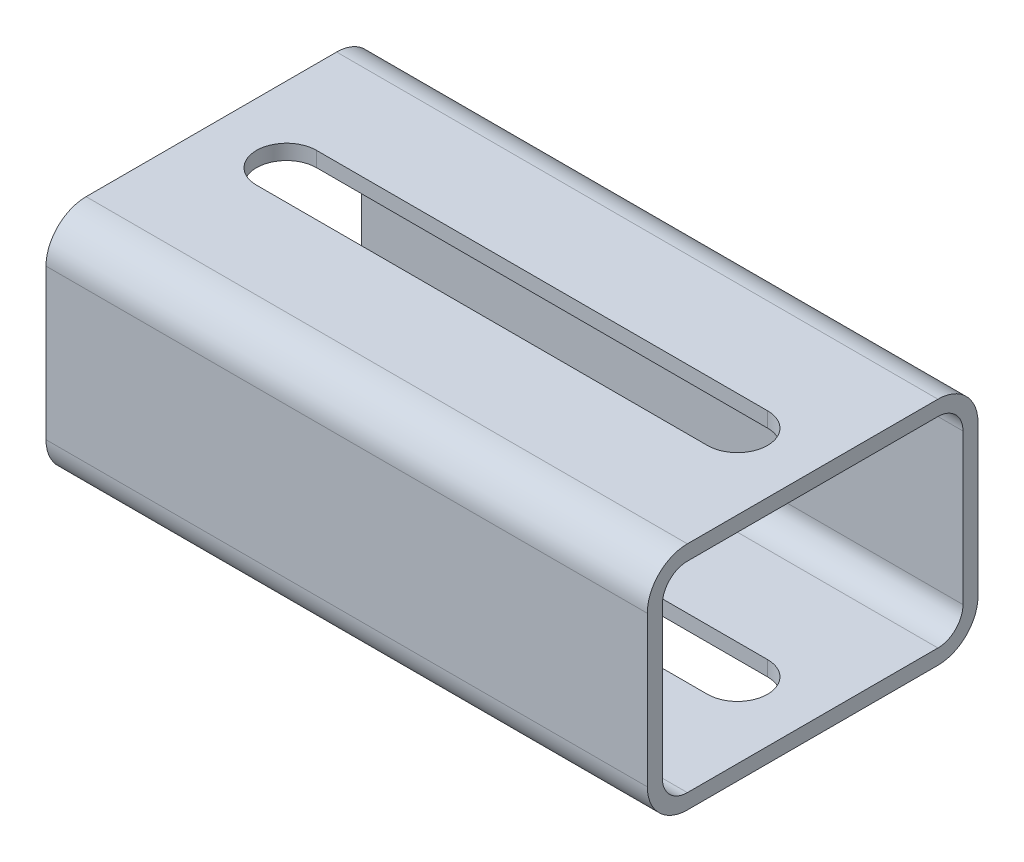
ISO-10303-21;
HEADER;
FILE_DESCRIPTION(('STEP AP214'),'2;1');
FILE_NAME('part.step','',(''),(''),'','','');
FILE_SCHEMA(('AUTOMOTIVE_DESIGN { 1 0 10303 214 1 1 1 1 }'));
ENDSEC;
DATA;
#1=APPLICATION_CONTEXT('core data for automotive mechanical design processes');
#2=APPLICATION_PROTOCOL_DEFINITION('international standard','automotive_design',2000,#1);
#3=PRODUCT_CONTEXT('',#1,'mechanical');
#4=PRODUCT('Part','Part','',(#3));
#5=PRODUCT_RELATED_PRODUCT_CATEGORY('part','',(#4));
#6=PRODUCT_DEFINITION_FORMATION('','',#4);
#7=PRODUCT_DEFINITION_CONTEXT('part definition',#1,'design');
#8=PRODUCT_DEFINITION('design','',#6,#7);
#9=PRODUCT_DEFINITION_SHAPE('','',#8);
#10=(LENGTH_UNIT() NAMED_UNIT(*) SI_UNIT(.MILLI.,.METRE.));
#11=(NAMED_UNIT(*) PLANE_ANGLE_UNIT() SI_UNIT($,.RADIAN.));
#12=(NAMED_UNIT(*) SI_UNIT($,.STERADIAN.) SOLID_ANGLE_UNIT());
#13=UNCERTAINTY_MEASURE_WITH_UNIT(LENGTH_MEASURE(1.E-05),#10,'distance_accuracy_value','');
#14=(GEOMETRIC_REPRESENTATION_CONTEXT(3) GLOBAL_UNCERTAINTY_ASSIGNED_CONTEXT((#13)) GLOBAL_UNIT_ASSIGNED_CONTEXT((#10,
#11,#12)) REPRESENTATION_CONTEXT('',''));
#15=CARTESIAN_POINT('',(0.,0.,0.));
#16=DIRECTION('',(0.,0.,1.));
#17=DIRECTION('',(1.,0.,0.));
#18=AXIS2_PLACEMENT_3D('',#15,#16,#17);
#19=CARTESIAN_POINT('',(60.,-15.,25.));
#20=DIRECTION('',(1.,0.,0.));
#21=DIRECTION('',(0.,0.,-1.));
#22=AXIS2_PLACEMENT_3D('',#19,#20,#21);
#23=PLANE('',#22);
#24=CARTESIAN_POINT('',(60.,-15.,25.));
#25=DIRECTION('',(1.,0.,0.));
#26=DIRECTION('',(0.,0.,-1.));
#27=AXIS2_PLACEMENT_3D('',#24,#25,#26);
#28=CIRCLE('',#27,8.);
#29=CARTESIAN_POINT('',(60.,-15.,33.));
#30=VERTEX_POINT('',#29);
#31=CARTESIAN_POINT('',(60.,-23.,25.));
#32=VERTEX_POINT('',#31);
#33=EDGE_CURVE('E403',#30,#32,#28,.T.);
#34=ORIENTED_EDGE('',*,*,#33,.T.);
#35=DIRECTION('',(0.,0.,-1.));
#36=VECTOR('',#35,1.);
#37=CARTESIAN_POINT('',(60.,-23.,25.));
#38=LINE('',#37,#36);
#39=CARTESIAN_POINT('',(60.,-23.,-25.));
#40=VERTEX_POINT('',#39);
#41=EDGE_CURVE('E407',#32,#40,#38,.T.);
#42=ORIENTED_EDGE('',*,*,#41,.T.);
#43=CARTESIAN_POINT('',(60.,-15.,-25.));
#44=DIRECTION('',(1.,0.,0.));
#45=DIRECTION('',(0.,0.,-1.));
#46=AXIS2_PLACEMENT_3D('',#43,#44,#45);
#47=CIRCLE('',#46,8.);
#48=CARTESIAN_POINT('',(60.,-14.9999999999999,-33.));
#49=VERTEX_POINT('',#48);
#50=EDGE_CURVE('E411',#40,#49,#47,.T.);
#51=ORIENTED_EDGE('',*,*,#50,.T.);
#52=DIRECTION('',(0.,1.,0.));
#53=VECTOR('',#52,1.);
#54=CARTESIAN_POINT('',(60.,15.,-33.));
#55=LINE('',#54,#53);
#56=CARTESIAN_POINT('',(60.,15.,-33.));
#57=VERTEX_POINT('',#56);
#58=EDGE_CURVE('E414',#49,#57,#55,.T.);
#59=ORIENTED_EDGE('',*,*,#58,.T.);
#60=CARTESIAN_POINT('',(60.,15.,-25.));
#61=DIRECTION('',(1.,0.,0.));
#62=DIRECTION('',(0.,0.,-1.));
#63=AXIS2_PLACEMENT_3D('',#60,#61,#62);
#64=CIRCLE('',#63,8.);
#65=CARTESIAN_POINT('',(60.,23.,-24.9999999999999));
#66=VERTEX_POINT('',#65);
#67=EDGE_CURVE('E417',#57,#66,#64,.T.);
#68=ORIENTED_EDGE('',*,*,#67,.T.);
#69=DIRECTION('',(0.,0.,1.));
#70=VECTOR('',#69,1.);
#71=CARTESIAN_POINT('',(60.,23.,25.));
#72=LINE('',#71,#70);
#73=CARTESIAN_POINT('',(60.,23.,25.));
#74=VERTEX_POINT('',#73);
#75=EDGE_CURVE('E420',#66,#74,#72,.T.);
#76=ORIENTED_EDGE('',*,*,#75,.T.);
#77=CARTESIAN_POINT('',(60.,15.,25.));
#78=DIRECTION('',(1.,0.,0.));
#79=DIRECTION('',(0.,0.,-1.));
#80=AXIS2_PLACEMENT_3D('',#77,#78,#79);
#81=CIRCLE('',#80,8.);
#82=CARTESIAN_POINT('',(60.,14.9999999999999,33.));
#83=VERTEX_POINT('',#82);
#84=EDGE_CURVE('E423',#74,#83,#81,.T.);
#85=ORIENTED_EDGE('',*,*,#84,.T.);
#86=DIRECTION('',(0.,-1.,0.));
#87=VECTOR('',#86,1.);
#88=CARTESIAN_POINT('',(60.,15.,33.));
#89=LINE('',#88,#87);
#90=EDGE_CURVE('E426',#83,#30,#89,.T.);
#91=ORIENTED_EDGE('',*,*,#90,.T.);
#92=EDGE_LOOP('',(#34,#42,#51,#59,#68,#76,#85,#91));
#93=FACE_BOUND('',#92,.T.);
#94=DIRECTION('',(0.,0.,-1.));
#95=VECTOR('',#94,1.);
#96=CARTESIAN_POINT('',(60.,-20.,25.));
#97=LINE('',#96,#95);
#98=CARTESIAN_POINT('',(60.,-20.,25.));
#99=VERTEX_POINT('',#98);
#100=CARTESIAN_POINT('',(60.,-20.,-25.));
#101=VERTEX_POINT('',#100);
#102=EDGE_CURVE('E323',#99,#101,#97,.T.);
#103=ORIENTED_EDGE('',*,*,#102,.F.);
#104=CARTESIAN_POINT('',(60.,-15.,25.));
#105=DIRECTION('',(1.,0.,0.));
#106=DIRECTION('',(0.,0.,-1.));
#107=AXIS2_PLACEMENT_3D('',#104,#105,#106);
#108=CIRCLE('',#107,5.);
#109=CARTESIAN_POINT('',(60.,-15.,30.));
#110=VERTEX_POINT('',#109);
#111=EDGE_CURVE('E320',#110,#99,#108,.T.);
#112=ORIENTED_EDGE('',*,*,#111,.F.);
#113=DIRECTION('',(0.,-1.,0.));
#114=VECTOR('',#113,1.);
#115=CARTESIAN_POINT('',(60.,15.,30.));
#116=LINE('',#115,#114);
#117=CARTESIAN_POINT('',(60.,15.,30.));
#118=VERTEX_POINT('',#117);
#119=EDGE_CURVE('E343',#118,#110,#116,.T.);
#120=ORIENTED_EDGE('',*,*,#119,.F.);
#121=CARTESIAN_POINT('',(60.,15.,25.));
#122=DIRECTION('',(1.,0.,0.));
#123=DIRECTION('',(0.,0.,-1.));
#124=AXIS2_PLACEMENT_3D('',#121,#122,#123);
#125=CIRCLE('',#124,5.);
#126=CARTESIAN_POINT('',(60.,20.,25.));
#127=VERTEX_POINT('',#126);
#128=EDGE_CURVE('E339',#127,#118,#125,.T.);
#129=ORIENTED_EDGE('',*,*,#128,.F.);
#130=DIRECTION('',(0.,0.,1.));
#131=VECTOR('',#130,1.);
#132=CARTESIAN_POINT('',(60.,20.,25.));
#133=LINE('',#132,#131);
#134=CARTESIAN_POINT('',(60.,20.,-25.));
#135=VERTEX_POINT('',#134);
#136=EDGE_CURVE('E336',#135,#127,#133,.T.);
#137=ORIENTED_EDGE('',*,*,#136,.F.);
#138=CARTESIAN_POINT('',(60.,15.,-25.));
#139=DIRECTION('',(1.,0.,0.));
#140=DIRECTION('',(0.,0.,1.));
#141=AXIS2_PLACEMENT_3D('',#138,#139,#140);
#142=CIRCLE('',#141,5.);
#143=CARTESIAN_POINT('',(60.,15.,-30.));
#144=VERTEX_POINT('',#143);
#145=EDGE_CURVE('E333',#144,#135,#142,.T.);
#146=ORIENTED_EDGE('',*,*,#145,.F.);
#147=DIRECTION('',(0.,1.,0.));
#148=VECTOR('',#147,1.);
#149=CARTESIAN_POINT('',(60.,15.,-30.));
#150=LINE('',#149,#148);
#151=CARTESIAN_POINT('',(60.,-15.,-30.));
#152=VERTEX_POINT('',#151);
#153=EDGE_CURVE('E330',#152,#144,#150,.T.);
#154=ORIENTED_EDGE('',*,*,#153,.F.);
#155=CARTESIAN_POINT('',(60.,-15.,-25.));
#156=DIRECTION('',(1.,0.,0.));
#157=DIRECTION('',(0.,0.,-1.));
#158=AXIS2_PLACEMENT_3D('',#155,#156,#157);
#159=CIRCLE('',#158,5.);
#160=EDGE_CURVE('E327',#101,#152,#159,.T.);
#161=ORIENTED_EDGE('',*,*,#160,.F.);
#162=EDGE_LOOP('',(#103,#112,#120,#129,#137,#146,#154,#161));
#163=FACE_BOUND('',#162,.T.);
#164=ADVANCED_FACE('F87',(#93,#163),#23,.T.);
#165=CARTESIAN_POINT('',(-60.,-15.,25.));
#166=DIRECTION('',(1.,0.,0.));
#167=DIRECTION('',(0.,0.,-1.));
#168=AXIS2_PLACEMENT_3D('',#165,#166,#167);
#169=PLANE('',#168);
#170=CARTESIAN_POINT('',(-60.,-15.,25.));
#171=DIRECTION('',(1.,0.,0.));
#172=DIRECTION('',(0.,0.,-1.));
#173=AXIS2_PLACEMENT_3D('',#170,#171,#172);
#174=CIRCLE('',#173,8.);
#175=CARTESIAN_POINT('',(-60.,-15.,33.));
#176=VERTEX_POINT('',#175);
#177=CARTESIAN_POINT('',(-60.,-23.,25.));
#178=VERTEX_POINT('',#177);
#179=EDGE_CURVE('E402',#176,#178,#174,.T.);
#180=ORIENTED_EDGE('',*,*,#179,.F.);
#181=DIRECTION('',(0.,-1.,0.));
#182=VECTOR('',#181,1.);
#183=CARTESIAN_POINT('',(-60.,15.,33.));
#184=LINE('',#183,#182);
#185=CARTESIAN_POINT('',(-60.,14.9999999999999,33.));
#186=VERTEX_POINT('',#185);
#187=EDGE_CURVE('E408',#186,#176,#184,.T.);
#188=ORIENTED_EDGE('',*,*,#187,.F.);
#189=CARTESIAN_POINT('',(-60.,15.,25.));
#190=DIRECTION('',(1.,0.,0.));
#191=DIRECTION('',(0.,0.,-1.));
#192=AXIS2_PLACEMENT_3D('',#189,#190,#191);
#193=CIRCLE('',#192,8.);
#194=CARTESIAN_POINT('',(-60.,23.,25.));
#195=VERTEX_POINT('',#194);
#196=EDGE_CURVE('E448',#195,#186,#193,.T.);
#197=ORIENTED_EDGE('',*,*,#196,.F.);
#198=DIRECTION('',(0.,0.,1.));
#199=VECTOR('',#198,1.);
#200=CARTESIAN_POINT('',(-60.,23.,25.));
#201=LINE('',#200,#199);
#202=CARTESIAN_POINT('',(-60.,23.,-24.9999999999999));
#203=VERTEX_POINT('',#202);
#204=EDGE_CURVE('E445',#203,#195,#201,.T.);
#205=ORIENTED_EDGE('',*,*,#204,.F.);
#206=CARTESIAN_POINT('',(-60.,15.,-25.));
#207=DIRECTION('',(1.,0.,0.));
#208=DIRECTION('',(0.,0.,-1.));
#209=AXIS2_PLACEMENT_3D('',#206,#207,#208);
#210=CIRCLE('',#209,8.);
#211=CARTESIAN_POINT('',(-60.,15.,-33.));
#212=VERTEX_POINT('',#211);
#213=EDGE_CURVE('E442',#212,#203,#210,.T.);
#214=ORIENTED_EDGE('',*,*,#213,.F.);
#215=DIRECTION('',(0.,1.,0.));
#216=VECTOR('',#215,1.);
#217=CARTESIAN_POINT('',(-60.,15.,-33.));
#218=LINE('',#217,#216);
#219=CARTESIAN_POINT('',(-60.,-14.9999999999999,-33.));
#220=VERTEX_POINT('',#219);
#221=EDGE_CURVE('E439',#220,#212,#218,.T.);
#222=ORIENTED_EDGE('',*,*,#221,.F.);
#223=CARTESIAN_POINT('',(-60.,-15.,-25.));
#224=DIRECTION('',(1.,0.,0.));
#225=DIRECTION('',(0.,0.,-1.));
#226=AXIS2_PLACEMENT_3D('',#223,#224,#225);
#227=CIRCLE('',#226,8.);
#228=CARTESIAN_POINT('',(-60.,-23.,-25.));
#229=VERTEX_POINT('',#228);
#230=EDGE_CURVE('E436',#229,#220,#227,.T.);
#231=ORIENTED_EDGE('',*,*,#230,.F.);
#232=DIRECTION('',(0.,0.,-1.));
#233=VECTOR('',#232,1.);
#234=CARTESIAN_POINT('',(-60.,-23.,25.));
#235=LINE('',#234,#233);
#236=EDGE_CURVE('E433',#178,#229,#235,.T.);
#237=ORIENTED_EDGE('',*,*,#236,.F.);
#238=EDGE_LOOP('',(#180,#188,#197,#205,#214,#222,#231,#237));
#239=FACE_BOUND('',#238,.T.);
#240=CARTESIAN_POINT('',(-60.,-15.,25.));
#241=DIRECTION('',(1.,0.,0.));
#242=DIRECTION('',(0.,0.,-1.));
#243=AXIS2_PLACEMENT_3D('',#240,#241,#242);
#244=CIRCLE('',#243,5.);
#245=CARTESIAN_POINT('',(-60.,-15.,30.));
#246=VERTEX_POINT('',#245);
#247=CARTESIAN_POINT('',(-60.,-20.,25.));
#248=VERTEX_POINT('',#247);
#249=EDGE_CURVE('E319',#246,#248,#244,.T.);
#250=ORIENTED_EDGE('',*,*,#249,.T.);
#251=DIRECTION('',(0.,0.,-1.));
#252=VECTOR('',#251,1.);
#253=CARTESIAN_POINT('',(-60.,-20.,25.));
#254=LINE('',#253,#252);
#255=CARTESIAN_POINT('',(-60.,-20.,-25.));
#256=VERTEX_POINT('',#255);
#257=EDGE_CURVE('E350',#248,#256,#254,.T.);
#258=ORIENTED_EDGE('',*,*,#257,.T.);
#259=CARTESIAN_POINT('',(-60.,-15.,-25.));
#260=DIRECTION('',(1.,0.,0.));
#261=DIRECTION('',(0.,0.,-1.));
#262=AXIS2_PLACEMENT_3D('',#259,#260,#261);
#263=CIRCLE('',#262,5.);
#264=CARTESIAN_POINT('',(-60.,-15.,-30.));
#265=VERTEX_POINT('',#264);
#266=EDGE_CURVE('E354',#256,#265,#263,.T.);
#267=ORIENTED_EDGE('',*,*,#266,.T.);
#268=DIRECTION('',(0.,1.,0.));
#269=VECTOR('',#268,1.);
#270=CARTESIAN_POINT('',(-60.,15.,-30.));
#271=LINE('',#270,#269);
#272=CARTESIAN_POINT('',(-60.,15.,-30.));
#273=VERTEX_POINT('',#272);
#274=EDGE_CURVE('E358',#265,#273,#271,.T.);
#275=ORIENTED_EDGE('',*,*,#274,.T.);
#276=CARTESIAN_POINT('',(-60.,15.,-25.));
#277=DIRECTION('',(1.,0.,0.));
#278=DIRECTION('',(0.,0.,1.));
#279=AXIS2_PLACEMENT_3D('',#276,#277,#278);
#280=CIRCLE('',#279,5.);
#281=CARTESIAN_POINT('',(-60.,20.,-25.));
#282=VERTEX_POINT('',#281);
#283=EDGE_CURVE('E362',#273,#282,#280,.T.);
#284=ORIENTED_EDGE('',*,*,#283,.T.);
#285=DIRECTION('',(0.,0.,1.));
#286=VECTOR('',#285,1.);
#287=CARTESIAN_POINT('',(-60.,20.,25.));
#288=LINE('',#287,#286);
#289=CARTESIAN_POINT('',(-60.,20.,25.));
#290=VERTEX_POINT('',#289);
#291=EDGE_CURVE('E366',#282,#290,#288,.T.);
#292=ORIENTED_EDGE('',*,*,#291,.T.);
#293=CARTESIAN_POINT('',(-60.,15.,25.));
#294=DIRECTION('',(1.,0.,0.));
#295=DIRECTION('',(0.,0.,-1.));
#296=AXIS2_PLACEMENT_3D('',#293,#294,#295);
#297=CIRCLE('',#296,5.);
#298=CARTESIAN_POINT('',(-60.,15.,30.));
#299=VERTEX_POINT('',#298);
#300=EDGE_CURVE('E370',#290,#299,#297,.T.);
#301=ORIENTED_EDGE('',*,*,#300,.T.);
#302=DIRECTION('',(0.,-1.,0.));
#303=VECTOR('',#302,1.);
#304=CARTESIAN_POINT('',(-60.,15.,30.));
#305=LINE('',#304,#303);
#306=EDGE_CURVE('E324',#299,#246,#305,.T.);
#307=ORIENTED_EDGE('',*,*,#306,.T.);
#308=EDGE_LOOP('',(#250,#258,#267,#275,#284,#292,#301,#307));
#309=FACE_BOUND('',#308,.T.);
#310=ADVANCED_FACE('F533',(#239,#309),#169,.F.);
#311=CARTESIAN_POINT('',(60.,-15.,25.));
#312=DIRECTION('',(-1.,0.,0.));
#313=DIRECTION('',(0.,0.,1.));
#314=AXIS2_PLACEMENT_3D('',#311,#312,#313);
#315=CYLINDRICAL_SURFACE('',#314,8.);
#316=ORIENTED_EDGE('',*,*,#179,.T.);
#317=DIRECTION('',(-1.,0.,0.));
#318=VECTOR('',#317,1.);
#319=CARTESIAN_POINT('',(60.,-23.,25.));
#320=LINE('',#319,#318);
#321=EDGE_CURVE('E480',#32,#178,#320,.T.);
#322=ORIENTED_EDGE('',*,*,#321,.F.);
#323=ORIENTED_EDGE('',*,*,#33,.F.);
#324=DIRECTION('',(-1.,0.,0.));
#325=VECTOR('',#324,1.);
#326=CARTESIAN_POINT('',(60.,-15.,33.));
#327=LINE('',#326,#325);
#328=EDGE_CURVE('E429',#30,#176,#327,.T.);
#329=ORIENTED_EDGE('',*,*,#328,.T.);
#330=EDGE_LOOP('',(#316,#322,#323,#329));
#331=FACE_BOUND('',#330,.T.);
#332=ADVANCED_FACE('F89',(#331),#315,.T.);
#333=CARTESIAN_POINT('',(60.,-23.,25.));
#334=DIRECTION('',(0.,1.,0.));
#335=DIRECTION('',(0.,0.,1.));
#336=AXIS2_PLACEMENT_3D('',#333,#334,#335);
#337=PLANE('',#336);
#338=DIRECTION('',(-1.,0.,0.));
#339=VECTOR('',#338,1.);
#340=CARTESIAN_POINT('',(-45.,-23.,-6.));
#341=LINE('',#340,#339);
#342=CARTESIAN_POINT('',(45.,-23.,-6.));
#343=VERTEX_POINT('',#342);
#344=CARTESIAN_POINT('',(-45.,-23.,-6.));
#345=VERTEX_POINT('',#344);
#346=EDGE_CURVE('E275',#343,#345,#341,.T.);
#347=ORIENTED_EDGE('',*,*,#346,.T.);
#348=CARTESIAN_POINT('',(-45.,-23.,0.));
#349=DIRECTION('',(0.,1.,0.));
#350=DIRECTION('',(0.,0.,1.));
#351=AXIS2_PLACEMENT_3D('',#348,#349,#350);
#352=CIRCLE('',#351,6.);
#353=CARTESIAN_POINT('',(-45.,-23.,6.));
#354=VERTEX_POINT('',#353);
#355=EDGE_CURVE('E255',#345,#354,#352,.T.);
#356=ORIENTED_EDGE('',*,*,#355,.T.);
#357=DIRECTION('',(1.,0.,0.));
#358=VECTOR('',#357,1.);
#359=CARTESIAN_POINT('',(-45.,-23.,6.));
#360=LINE('',#359,#358);
#361=CARTESIAN_POINT('',(45.,-23.,6.));
#362=VERTEX_POINT('',#361);
#363=EDGE_CURVE('E266',#354,#362,#360,.T.);
#364=ORIENTED_EDGE('',*,*,#363,.T.);
#365=CARTESIAN_POINT('',(45.,-23.,0.));
#366=DIRECTION('',(0.,1.,0.));
#367=DIRECTION('',(0.,0.,1.));
#368=AXIS2_PLACEMENT_3D('',#365,#366,#367);
#369=CIRCLE('',#368,6.);
#370=EDGE_CURVE('E103',#362,#343,#369,.T.);
#371=ORIENTED_EDGE('',*,*,#370,.T.);
#372=EDGE_LOOP('',(#347,#356,#364,#371));
#373=FACE_BOUND('',#372,.T.);
#374=ORIENTED_EDGE('',*,*,#236,.T.);
#375=DIRECTION('',(-1.,0.,0.));
#376=VECTOR('',#375,1.);
#377=CARTESIAN_POINT('',(60.,-23.,-25.));
#378=LINE('',#377,#376);
#379=EDGE_CURVE('E476',#40,#229,#378,.T.);
#380=ORIENTED_EDGE('',*,*,#379,.F.);
#381=ORIENTED_EDGE('',*,*,#41,.F.);
#382=ORIENTED_EDGE('',*,*,#321,.T.);
#383=EDGE_LOOP('',(#374,#380,#381,#382));
#384=FACE_BOUND('',#383,.T.);
#385=ADVANCED_FACE('F272',(#373,#384),#337,.F.);
#386=CARTESIAN_POINT('',(60.,-15.,-25.));
#387=DIRECTION('',(-1.,0.,0.));
#388=DIRECTION('',(0.,0.,1.));
#389=AXIS2_PLACEMENT_3D('',#386,#387,#388);
#390=CYLINDRICAL_SURFACE('',#389,8.);
#391=ORIENTED_EDGE('',*,*,#230,.T.);
#392=DIRECTION('',(-1.,0.,0.));
#393=VECTOR('',#392,1.);
#394=CARTESIAN_POINT('',(60.,-14.9999999999999,-33.));
#395=LINE('',#394,#393);
#396=EDGE_CURVE('E472',#49,#220,#395,.T.);
#397=ORIENTED_EDGE('',*,*,#396,.F.);
#398=ORIENTED_EDGE('',*,*,#50,.F.);
#399=ORIENTED_EDGE('',*,*,#379,.T.);
#400=EDGE_LOOP('',(#391,#397,#398,#399));
#401=FACE_BOUND('',#400,.T.);
#402=ADVANCED_FACE('F556',(#401),#390,.T.);
#403=CARTESIAN_POINT('',(60.,15.,-33.));
#404=DIRECTION('',(0.,0.,1.));
#405=DIRECTION('',(0.,-1.,0.));
#406=AXIS2_PLACEMENT_3D('',#403,#404,#405);
#407=PLANE('',#406);
#408=ORIENTED_EDGE('',*,*,#221,.T.);
#409=DIRECTION('',(-1.,0.,0.));
#410=VECTOR('',#409,1.);
#411=CARTESIAN_POINT('',(60.,15.,-33.));
#412=LINE('',#411,#410);
#413=EDGE_CURVE('E468',#57,#212,#412,.T.);
#414=ORIENTED_EDGE('',*,*,#413,.F.);
#415=ORIENTED_EDGE('',*,*,#58,.F.);
#416=ORIENTED_EDGE('',*,*,#396,.T.);
#417=EDGE_LOOP('',(#408,#414,#415,#416));
#418=FACE_BOUND('',#417,.T.);
#419=ADVANCED_FACE('F552',(#418),#407,.F.);
#420=CARTESIAN_POINT('',(60.,15.,-25.));
#421=DIRECTION('',(-1.,0.,0.));
#422=DIRECTION('',(0.,0.,1.));
#423=AXIS2_PLACEMENT_3D('',#420,#421,#422);
#424=CYLINDRICAL_SURFACE('',#423,8.);
#425=ORIENTED_EDGE('',*,*,#213,.T.);
#426=DIRECTION('',(-1.,0.,0.));
#427=VECTOR('',#426,1.);
#428=CARTESIAN_POINT('',(60.,23.,-24.9999999999999));
#429=LINE('',#428,#427);
#430=EDGE_CURVE('E464',#66,#203,#429,.T.);
#431=ORIENTED_EDGE('',*,*,#430,.F.);
#432=ORIENTED_EDGE('',*,*,#67,.F.);
#433=ORIENTED_EDGE('',*,*,#413,.T.);
#434=EDGE_LOOP('',(#425,#431,#432,#433));
#435=FACE_BOUND('',#434,.T.);
#436=ADVANCED_FACE('F519',(#435),#424,.T.);
#437=CARTESIAN_POINT('',(60.,23.,25.));
#438=DIRECTION('',(0.,-1.,0.));
#439=DIRECTION('',(0.,0.,-1.));
#440=AXIS2_PLACEMENT_3D('',#437,#438,#439);
#441=PLANE('',#440);
#442=DIRECTION('',(1.,0.,0.));
#443=VECTOR('',#442,1.);
#444=CARTESIAN_POINT('',(-45.,23.,6.));
#445=LINE('',#444,#443);
#446=CARTESIAN_POINT('',(-45.,23.,6.));
#447=VERTEX_POINT('',#446);
#448=CARTESIAN_POINT('',(45.,23.,6.));
#449=VERTEX_POINT('',#448);
#450=EDGE_CURVE('E290',#447,#449,#445,.T.);
#451=ORIENTED_EDGE('',*,*,#450,.F.);
#452=CARTESIAN_POINT('',(-45.,23.,0.));
#453=DIRECTION('',(0.,1.,0.));
#454=DIRECTION('',(0.,0.,1.));
#455=AXIS2_PLACEMENT_3D('',#452,#453,#454);
#456=CIRCLE('',#455,6.);
#457=CARTESIAN_POINT('',(-45.,23.,-6.));
#458=VERTEX_POINT('',#457);
#459=EDGE_CURVE('E111',#458,#447,#456,.T.);
#460=ORIENTED_EDGE('',*,*,#459,.F.);
#461=DIRECTION('',(-1.,0.,0.));
#462=VECTOR('',#461,1.);
#463=CARTESIAN_POINT('',(-45.,23.,-6.));
#464=LINE('',#463,#462);
#465=CARTESIAN_POINT('',(45.,23.,-6.));
#466=VERTEX_POINT('',#465);
#467=EDGE_CURVE('E277',#466,#458,#464,.T.);
#468=ORIENTED_EDGE('',*,*,#467,.F.);
#469=CARTESIAN_POINT('',(45.,23.,0.));
#470=DIRECTION('',(0.,1.,0.));
#471=DIRECTION('',(0.,0.,1.));
#472=AXIS2_PLACEMENT_3D('',#469,#470,#471);
#473=CIRCLE('',#472,6.);
#474=EDGE_CURVE('E281',#449,#466,#473,.T.);
#475=ORIENTED_EDGE('',*,*,#474,.F.);
#476=EDGE_LOOP('',(#451,#460,#468,#475));
#477=FACE_BOUND('',#476,.T.);
#478=ORIENTED_EDGE('',*,*,#204,.T.);
#479=DIRECTION('',(-1.,0.,0.));
#480=VECTOR('',#479,1.);
#481=CARTESIAN_POINT('',(60.,23.,25.));
#482=LINE('',#481,#480);
#483=EDGE_CURVE('E460',#74,#195,#482,.T.);
#484=ORIENTED_EDGE('',*,*,#483,.F.);
#485=ORIENTED_EDGE('',*,*,#75,.F.);
#486=ORIENTED_EDGE('',*,*,#430,.T.);
#487=EDGE_LOOP('',(#478,#484,#485,#486));
#488=FACE_BOUND('',#487,.T.);
#489=ADVANCED_FACE('F515',(#477,#488),#441,.F.);
#490=CARTESIAN_POINT('',(60.,15.,25.));
#491=DIRECTION('',(-1.,0.,0.));
#492=DIRECTION('',(0.,0.,1.));
#493=AXIS2_PLACEMENT_3D('',#490,#491,#492);
#494=CYLINDRICAL_SURFACE('',#493,8.);
#495=ORIENTED_EDGE('',*,*,#196,.T.);
#496=DIRECTION('',(-1.,0.,0.));
#497=VECTOR('',#496,1.);
#498=CARTESIAN_POINT('',(60.,14.9999999999999,33.));
#499=LINE('',#498,#497);
#500=EDGE_CURVE('E456',#83,#186,#499,.T.);
#501=ORIENTED_EDGE('',*,*,#500,.F.);
#502=ORIENTED_EDGE('',*,*,#84,.F.);
#503=ORIENTED_EDGE('',*,*,#483,.T.);
#504=EDGE_LOOP('',(#495,#501,#502,#503));
#505=FACE_BOUND('',#504,.T.);
#506=ADVANCED_FACE('F518',(#505),#494,.T.);
#507=CARTESIAN_POINT('',(60.,15.,33.));
#508=DIRECTION('',(0.,0.,-1.));
#509=DIRECTION('',(0.,1.,0.));
#510=AXIS2_PLACEMENT_3D('',#507,#508,#509);
#511=PLANE('',#510);
#512=ORIENTED_EDGE('',*,*,#187,.T.);
#513=ORIENTED_EDGE('',*,*,#328,.F.);
#514=ORIENTED_EDGE('',*,*,#90,.F.);
#515=ORIENTED_EDGE('',*,*,#500,.T.);
#516=EDGE_LOOP('',(#512,#513,#514,#515));
#517=FACE_BOUND('',#516,.T.);
#518=ADVANCED_FACE('F537',(#517),#511,.F.);
#519=CARTESIAN_POINT('',(60.,-15.,25.));
#520=DIRECTION('',(-1.,0.,0.));
#521=DIRECTION('',(0.,0.,1.));
#522=AXIS2_PLACEMENT_3D('',#519,#520,#521);
#523=CYLINDRICAL_SURFACE('',#522,5.);
#524=ORIENTED_EDGE('',*,*,#249,.F.);
#525=DIRECTION('',(-1.,0.,0.));
#526=VECTOR('',#525,1.);
#527=CARTESIAN_POINT('',(60.,-15.,30.));
#528=LINE('',#527,#526);
#529=EDGE_CURVE('E346',#110,#246,#528,.T.);
#530=ORIENTED_EDGE('',*,*,#529,.F.);
#531=ORIENTED_EDGE('',*,*,#111,.T.);
#532=DIRECTION('',(-1.,0.,0.));
#533=VECTOR('',#532,1.);
#534=CARTESIAN_POINT('',(60.,-20.,25.));
#535=LINE('',#534,#533);
#536=EDGE_CURVE('E398',#99,#248,#535,.T.);
#537=ORIENTED_EDGE('',*,*,#536,.T.);
#538=EDGE_LOOP('',(#524,#530,#531,#537));
#539=FACE_BOUND('',#538,.T.);
#540=ADVANCED_FACE('F570',(#539),#523,.F.);
#541=CARTESIAN_POINT('',(60.,-20.,25.));
#542=DIRECTION('',(0.,1.,0.));
#543=DIRECTION('',(0.,0.,1.));
#544=AXIS2_PLACEMENT_3D('',#541,#542,#543);
#545=PLANE('',#544);
#546=CARTESIAN_POINT('',(-45.,-20.,0.));
#547=DIRECTION('',(0.,1.,0.));
#548=DIRECTION('',(0.,0.,1.));
#549=AXIS2_PLACEMENT_3D('',#546,#547,#548);
#550=CIRCLE('',#549,6.);
#551=CARTESIAN_POINT('',(-45.,-20.,-6.));
#552=VERTEX_POINT('',#551);
#553=CARTESIAN_POINT('',(-45.,-20.,6.));
#554=VERTEX_POINT('',#553);
#555=EDGE_CURVE('E258',#552,#554,#550,.T.);
#556=ORIENTED_EDGE('',*,*,#555,.F.);
#557=DIRECTION('',(-1.,0.,0.));
#558=VECTOR('',#557,1.);
#559=CARTESIAN_POINT('',(60.,-20.,-6.));
#560=LINE('',#559,#558);
#561=CARTESIAN_POINT('',(45.,-20.,-6.));
#562=VERTEX_POINT('',#561);
#563=EDGE_CURVE('E314',#562,#552,#560,.T.);
#564=ORIENTED_EDGE('',*,*,#563,.F.);
#565=CARTESIAN_POINT('',(45.,-20.,0.));
#566=DIRECTION('',(0.,1.,0.));
#567=DIRECTION('',(0.,0.,1.));
#568=AXIS2_PLACEMENT_3D('',#565,#566,#567);
#569=CIRCLE('',#568,6.);
#570=CARTESIAN_POINT('',(45.,-20.,6.));
#571=VERTEX_POINT('',#570);
#572=EDGE_CURVE('E311',#571,#562,#569,.T.);
#573=ORIENTED_EDGE('',*,*,#572,.F.);
#574=DIRECTION('',(1.,0.,0.));
#575=VECTOR('',#574,1.);
#576=CARTESIAN_POINT('',(60.,-20.,6.));
#577=LINE('',#576,#575);
#578=EDGE_CURVE('E300',#554,#571,#577,.T.);
#579=ORIENTED_EDGE('',*,*,#578,.F.);
#580=EDGE_LOOP('',(#556,#564,#573,#579));
#581=FACE_BOUND('',#580,.T.);
#582=ORIENTED_EDGE('',*,*,#257,.F.);
#583=ORIENTED_EDGE('',*,*,#536,.F.);
#584=ORIENTED_EDGE('',*,*,#102,.T.);
#585=DIRECTION('',(-1.,0.,0.));
#586=VECTOR('',#585,1.);
#587=CARTESIAN_POINT('',(60.,-20.,-25.));
#588=LINE('',#587,#586);
#589=EDGE_CURVE('E395',#101,#256,#588,.T.);
#590=ORIENTED_EDGE('',*,*,#589,.T.);
#591=EDGE_LOOP('',(#582,#583,#584,#590));
#592=FACE_BOUND('',#591,.T.);
#593=ADVANCED_FACE('F607',(#581,#592),#545,.T.);
#594=CARTESIAN_POINT('',(60.,-15.,-25.));
#595=DIRECTION('',(-1.,0.,0.));
#596=DIRECTION('',(0.,0.,1.));
#597=AXIS2_PLACEMENT_3D('',#594,#595,#596);
#598=CYLINDRICAL_SURFACE('',#597,5.);
#599=ORIENTED_EDGE('',*,*,#266,.F.);
#600=ORIENTED_EDGE('',*,*,#589,.F.);
#601=ORIENTED_EDGE('',*,*,#160,.T.);
#602=DIRECTION('',(-1.,0.,0.));
#603=VECTOR('',#602,1.);
#604=CARTESIAN_POINT('',(60.,-15.,-30.));
#605=LINE('',#604,#603);
#606=EDGE_CURVE('E392',#152,#265,#605,.T.);
#607=ORIENTED_EDGE('',*,*,#606,.T.);
#608=EDGE_LOOP('',(#599,#600,#601,#607));
#609=FACE_BOUND('',#608,.T.);
#610=ADVANCED_FACE('F614',(#609),#598,.F.);
#611=CARTESIAN_POINT('',(60.,15.,-30.));
#612=DIRECTION('',(0.,0.,1.));
#613=DIRECTION('',(0.,-1.,0.));
#614=AXIS2_PLACEMENT_3D('',#611,#612,#613);
#615=PLANE('',#614);
#616=ORIENTED_EDGE('',*,*,#274,.F.);
#617=ORIENTED_EDGE('',*,*,#606,.F.);
#618=ORIENTED_EDGE('',*,*,#153,.T.);
#619=DIRECTION('',(-1.,0.,0.));
#620=VECTOR('',#619,1.);
#621=CARTESIAN_POINT('',(60.,15.,-30.));
#622=LINE('',#621,#620);
#623=EDGE_CURVE('E389',#144,#273,#622,.T.);
#624=ORIENTED_EDGE('',*,*,#623,.T.);
#625=EDGE_LOOP('',(#616,#617,#618,#624));
#626=FACE_BOUND('',#625,.T.);
#627=ADVANCED_FACE('F621',(#626),#615,.T.);
#628=CARTESIAN_POINT('',(60.,15.,-25.));
#629=DIRECTION('',(-1.,0.,0.));
#630=DIRECTION('',(0.,0.,1.));
#631=AXIS2_PLACEMENT_3D('',#628,#629,#630);
#632=CYLINDRICAL_SURFACE('',#631,5.);
#633=ORIENTED_EDGE('',*,*,#283,.F.);
#634=ORIENTED_EDGE('',*,*,#623,.F.);
#635=ORIENTED_EDGE('',*,*,#145,.T.);
#636=DIRECTION('',(-1.,0.,0.));
#637=VECTOR('',#636,1.);
#638=CARTESIAN_POINT('',(60.,20.,-25.));
#639=LINE('',#638,#637);
#640=EDGE_CURVE('E386',#135,#282,#639,.T.);
#641=ORIENTED_EDGE('',*,*,#640,.T.);
#642=EDGE_LOOP('',(#633,#634,#635,#641));
#643=FACE_BOUND('',#642,.T.);
#644=ADVANCED_FACE('F629',(#643),#632,.F.);
#645=CARTESIAN_POINT('',(60.,20.,25.));
#646=DIRECTION('',(0.,-1.,0.));
#647=DIRECTION('',(0.,0.,-1.));
#648=AXIS2_PLACEMENT_3D('',#645,#646,#647);
#649=PLANE('',#648);
#650=CARTESIAN_POINT('',(-45.,20.,0.));
#651=DIRECTION('',(0.,-1.,0.));
#652=DIRECTION('',(0.,0.,-1.));
#653=AXIS2_PLACEMENT_3D('',#650,#651,#652);
#654=CIRCLE('',#653,6.);
#655=CARTESIAN_POINT('',(-45.,20.,6.));
#656=VERTEX_POINT('',#655);
#657=CARTESIAN_POINT('',(-45.,20.,-6.));
#658=VERTEX_POINT('',#657);
#659=EDGE_CURVE('E12',#656,#658,#654,.T.);
#660=ORIENTED_EDGE('',*,*,#659,.F.);
#661=DIRECTION('',(-1.,0.,0.));
#662=VECTOR('',#661,1.);
#663=CARTESIAN_POINT('',(60.,20.,6.));
#664=LINE('',#663,#662);
#665=CARTESIAN_POINT('',(45.,20.,6.));
#666=VERTEX_POINT('',#665);
#667=EDGE_CURVE('E484',#666,#656,#664,.T.);
#668=ORIENTED_EDGE('',*,*,#667,.F.);
#669=CARTESIAN_POINT('',(45.,20.,0.));
#670=DIRECTION('',(0.,-1.,0.));
#671=DIRECTION('',(0.,0.,-1.));
#672=AXIS2_PLACEMENT_3D('',#669,#670,#671);
#673=CIRCLE('',#672,6.);
#674=CARTESIAN_POINT('',(45.,20.,-6.));
#675=VERTEX_POINT('',#674);
#676=EDGE_CURVE('E487',#675,#666,#673,.T.);
#677=ORIENTED_EDGE('',*,*,#676,.F.);
#678=DIRECTION('',(1.,0.,0.));
#679=VECTOR('',#678,1.);
#680=CARTESIAN_POINT('',(60.,20.,-6.));
#681=LINE('',#680,#679);
#682=EDGE_CURVE('E96',#658,#675,#681,.T.);
#683=ORIENTED_EDGE('',*,*,#682,.F.);
#684=EDGE_LOOP('',(#660,#668,#677,#683));
#685=FACE_BOUND('',#684,.T.);
#686=ORIENTED_EDGE('',*,*,#291,.F.);
#687=ORIENTED_EDGE('',*,*,#640,.F.);
#688=ORIENTED_EDGE('',*,*,#136,.T.);
#689=DIRECTION('',(-1.,0.,0.));
#690=VECTOR('',#689,1.);
#691=CARTESIAN_POINT('',(60.,20.,25.));
#692=LINE('',#691,#690);
#693=EDGE_CURVE('E383',#127,#290,#692,.T.);
#694=ORIENTED_EDGE('',*,*,#693,.T.);
#695=EDGE_LOOP('',(#686,#687,#688,#694));
#696=FACE_BOUND('',#695,.T.);
#697=ADVANCED_FACE('F505',(#685,#696),#649,.T.);
#698=CARTESIAN_POINT('',(60.,15.,25.));
#699=DIRECTION('',(-1.,0.,0.));
#700=DIRECTION('',(0.,0.,1.));
#701=AXIS2_PLACEMENT_3D('',#698,#699,#700);
#702=CYLINDRICAL_SURFACE('',#701,5.);
#703=ORIENTED_EDGE('',*,*,#300,.F.);
#704=ORIENTED_EDGE('',*,*,#693,.F.);
#705=ORIENTED_EDGE('',*,*,#128,.T.);
#706=DIRECTION('',(-1.,0.,0.));
#707=VECTOR('',#706,1.);
#708=CARTESIAN_POINT('',(60.,15.,30.));
#709=LINE('',#708,#707);
#710=EDGE_CURVE('E380',#118,#299,#709,.T.);
#711=ORIENTED_EDGE('',*,*,#710,.T.);
#712=EDGE_LOOP('',(#703,#704,#705,#711));
#713=FACE_BOUND('',#712,.T.);
#714=ADVANCED_FACE('F644',(#713),#702,.F.);
#715=CARTESIAN_POINT('',(60.,15.,30.));
#716=DIRECTION('',(0.,0.,-1.));
#717=DIRECTION('',(0.,1.,0.));
#718=AXIS2_PLACEMENT_3D('',#715,#716,#717);
#719=PLANE('',#718);
#720=ORIENTED_EDGE('',*,*,#306,.F.);
#721=ORIENTED_EDGE('',*,*,#710,.F.);
#722=ORIENTED_EDGE('',*,*,#119,.T.);
#723=ORIENTED_EDGE('',*,*,#529,.T.);
#724=EDGE_LOOP('',(#720,#721,#722,#723));
#725=FACE_BOUND('',#724,.T.);
#726=ADVANCED_FACE('F651',(#725),#719,.T.);
#727=CARTESIAN_POINT('',(-45.,-23.,6.));
#728=DIRECTION('',(0.,0.,1.));
#729=DIRECTION('',(1.,0.,0.));
#730=AXIS2_PLACEMENT_3D('',#727,#728,#729);
#731=PLANE('',#730);
#732=ORIENTED_EDGE('',*,*,#667,.T.);
#733=DIRECTION('',(0.,1.,0.));
#734=VECTOR('',#733,1.);
#735=CARTESIAN_POINT('',(-45.,-23.,6.));
#736=LINE('',#735,#734);
#737=EDGE_CURVE('E263',#656,#447,#736,.T.);
#738=ORIENTED_EDGE('',*,*,#737,.T.);
#739=ORIENTED_EDGE('',*,*,#450,.T.);
#740=DIRECTION('',(0.,1.,0.));
#741=VECTOR('',#740,1.);
#742=CARTESIAN_POINT('',(45.,-23.,6.));
#743=LINE('',#742,#741);
#744=EDGE_CURVE('E262',#666,#449,#743,.T.);
#745=ORIENTED_EDGE('',*,*,#744,.F.);
#746=EDGE_LOOP('',(#732,#738,#739,#745));
#747=FACE_BOUND('',#746,.T.);
#748=ADVANCED_FACE('F508',(#747),#731,.F.);
#749=CARTESIAN_POINT('',(45.,-23.,0.));
#750=DIRECTION('',(0.,1.,0.));
#751=DIRECTION('',(0.,0.,1.));
#752=AXIS2_PLACEMENT_3D('',#749,#750,#751);
#753=CYLINDRICAL_SURFACE('',#752,6.);
#754=ORIENTED_EDGE('',*,*,#676,.T.);
#755=ORIENTED_EDGE('',*,*,#744,.T.);
#756=ORIENTED_EDGE('',*,*,#474,.T.);
#757=DIRECTION('',(0.,1.,0.));
#758=VECTOR('',#757,1.);
#759=CARTESIAN_POINT('',(45.,-23.,-6.));
#760=LINE('',#759,#758);
#761=EDGE_CURVE('E306',#675,#466,#760,.T.);
#762=ORIENTED_EDGE('',*,*,#761,.F.);
#763=EDGE_LOOP('',(#754,#755,#756,#762));
#764=FACE_BOUND('',#763,.T.);
#765=ADVANCED_FACE('F500',(#764),#753,.F.);
#766=CARTESIAN_POINT('',(-45.,-23.,-6.));
#767=DIRECTION('',(0.,0.,-1.));
#768=DIRECTION('',(-1.,0.,0.));
#769=AXIS2_PLACEMENT_3D('',#766,#767,#768);
#770=PLANE('',#769);
#771=ORIENTED_EDGE('',*,*,#682,.T.);
#772=ORIENTED_EDGE('',*,*,#761,.T.);
#773=ORIENTED_EDGE('',*,*,#467,.T.);
#774=DIRECTION('',(0.,1.,0.));
#775=VECTOR('',#774,1.);
#776=CARTESIAN_POINT('',(-45.,-23.,-6.));
#777=LINE('',#776,#775);
#778=EDGE_CURVE('E301',#658,#458,#777,.T.);
#779=ORIENTED_EDGE('',*,*,#778,.F.);
#780=EDGE_LOOP('',(#771,#772,#773,#779));
#781=FACE_BOUND('',#780,.T.);
#782=ADVANCED_FACE('F495',(#781),#770,.F.);
#783=CARTESIAN_POINT('',(-45.,-23.,0.));
#784=DIRECTION('',(0.,1.,0.));
#785=DIRECTION('',(0.,0.,1.));
#786=AXIS2_PLACEMENT_3D('',#783,#784,#785);
#787=CYLINDRICAL_SURFACE('',#786,6.);
#788=ORIENTED_EDGE('',*,*,#659,.T.);
#789=ORIENTED_EDGE('',*,*,#778,.T.);
#790=ORIENTED_EDGE('',*,*,#459,.T.);
#791=ORIENTED_EDGE('',*,*,#737,.F.);
#792=EDGE_LOOP('',(#788,#789,#790,#791));
#793=FACE_BOUND('',#792,.T.);
#794=ADVANCED_FACE('F510',(#793),#787,.F.);
#795=ORIENTED_EDGE('',*,*,#555,.T.);
#796=EDGE_CURVE('E250',#354,#554,#736,.T.);
#797=ORIENTED_EDGE('',*,*,#796,.F.);
#798=ORIENTED_EDGE('',*,*,#355,.F.);
#799=EDGE_CURVE('E297',#345,#552,#777,.T.);
#800=ORIENTED_EDGE('',*,*,#799,.T.);
#801=EDGE_LOOP('',(#795,#797,#798,#800));
#802=FACE_BOUND('',#801,.T.);
#803=ADVANCED_FACE('F252',(#802),#787,.F.);
#804=ORIENTED_EDGE('',*,*,#563,.T.);
#805=ORIENTED_EDGE('',*,*,#799,.F.);
#806=ORIENTED_EDGE('',*,*,#346,.F.);
#807=EDGE_CURVE('E302',#343,#562,#760,.T.);
#808=ORIENTED_EDGE('',*,*,#807,.T.);
#809=EDGE_LOOP('',(#804,#805,#806,#808));
#810=FACE_BOUND('',#809,.T.);
#811=ADVANCED_FACE('F679',(#810),#770,.F.);
#812=ORIENTED_EDGE('',*,*,#572,.T.);
#813=ORIENTED_EDGE('',*,*,#807,.F.);
#814=ORIENTED_EDGE('',*,*,#370,.F.);
#815=EDGE_CURVE('E268',#362,#571,#743,.T.);
#816=ORIENTED_EDGE('',*,*,#815,.T.);
#817=EDGE_LOOP('',(#812,#813,#814,#816));
#818=FACE_BOUND('',#817,.T.);
#819=ADVANCED_FACE('F672',(#818),#753,.F.);
#820=ORIENTED_EDGE('',*,*,#578,.T.);
#821=ORIENTED_EDGE('',*,*,#815,.F.);
#822=ORIENTED_EDGE('',*,*,#363,.F.);
#823=ORIENTED_EDGE('',*,*,#796,.T.);
#824=EDGE_LOOP('',(#820,#821,#822,#823));
#825=FACE_BOUND('',#824,.T.);
#826=ADVANCED_FACE('F267',(#825),#731,.F.);
#827=CLOSED_SHELL('',(#164,#310,#332,#385,#402,#419,#436,#489,#506,#518,#540,#593,#610,#627,
#644,#697,#714,#726,#748,#765,#782,#794,#803,#811,#819,#826));
#828=MANIFOLD_SOLID_BREP('B2',#827);
#829=ADVANCED_BREP_SHAPE_REPRESENTATION('',(#18,#828),#14);
#830=SHAPE_DEFINITION_REPRESENTATION(#9,#829);
ENDSEC;
END-ISO-10303-21;
